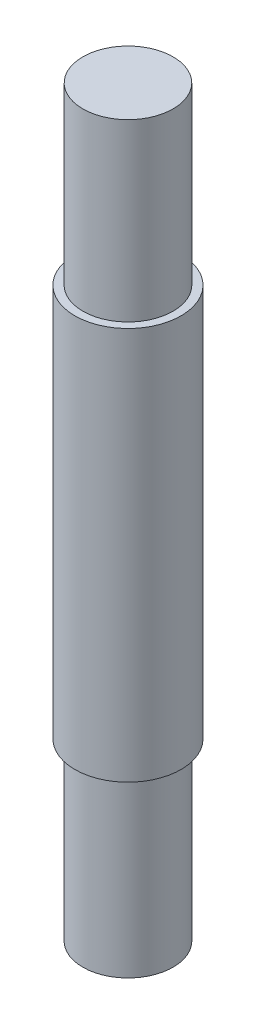
ISO-10303-21;
HEADER;
FILE_DESCRIPTION(('STEP AP214'),'2;1');
FILE_NAME('part.step','',(''),(''),'','','');
FILE_SCHEMA(('AUTOMOTIVE_DESIGN { 1 0 10303 214 1 1 1 1 }'));
ENDSEC;
DATA;
#1=APPLICATION_CONTEXT('core data for automotive mechanical design processes');
#2=APPLICATION_PROTOCOL_DEFINITION('international standard','automotive_design',2000,#1);
#3=PRODUCT_CONTEXT('',#1,'mechanical');
#4=PRODUCT('Part','Part','',(#3));
#5=PRODUCT_RELATED_PRODUCT_CATEGORY('part','',(#4));
#6=PRODUCT_DEFINITION_FORMATION('','',#4);
#7=PRODUCT_DEFINITION_CONTEXT('part definition',#1,'design');
#8=PRODUCT_DEFINITION('design','',#6,#7);
#9=PRODUCT_DEFINITION_SHAPE('','',#8);
#10=(LENGTH_UNIT() NAMED_UNIT(*) SI_UNIT(.MILLI.,.METRE.));
#11=(NAMED_UNIT(*) PLANE_ANGLE_UNIT() SI_UNIT($,.RADIAN.));
#12=(NAMED_UNIT(*) SI_UNIT($,.STERADIAN.) SOLID_ANGLE_UNIT());
#13=UNCERTAINTY_MEASURE_WITH_UNIT(LENGTH_MEASURE(1.E-05),#10,'distance_accuracy_value','');
#14=(GEOMETRIC_REPRESENTATION_CONTEXT(3) GLOBAL_UNCERTAINTY_ASSIGNED_CONTEXT((#13)) GLOBAL_UNIT_ASSIGNED_CONTEXT((#10,
#11,#12)) REPRESENTATION_CONTEXT('',''));
#15=CARTESIAN_POINT('',(0.,0.,0.));
#16=DIRECTION('',(0.,0.,1.));
#17=DIRECTION('',(1.,0.,0.));
#18=AXIS2_PLACEMENT_3D('',#15,#16,#17);
#19=CARTESIAN_POINT('',(0.,-70.,0.));
#20=DIRECTION('',(0.,1.,0.));
#21=DIRECTION('',(0.,0.,1.));
#22=AXIS2_PLACEMENT_3D('',#19,#20,#21);
#23=CYLINDRICAL_SURFACE('',#22,8.5);
#24=CARTESIAN_POINT('',(0.,-70.,0.));
#25=DIRECTION('',(0.,1.,0.));
#26=DIRECTION('',(0.,0.,1.));
#27=AXIS2_PLACEMENT_3D('',#24,#25,#26);
#28=CIRCLE('',#27,8.5);
#29=CARTESIAN_POINT('',(0.,-70.,8.5));
#30=VERTEX_POINT('',#29);
#31=EDGE_CURVE('E39',#30,#30,#28,.T.);
#32=ORIENTED_EDGE('',*,*,#31,.T.);
#33=EDGE_LOOP('',(#32));
#34=FACE_BOUND('',#33,.T.);
#35=CARTESIAN_POINT('',(0.,-37.,0.));
#36=DIRECTION('',(0.,1.,0.));
#37=DIRECTION('',(0.,0.,1.));
#38=AXIS2_PLACEMENT_3D('',#35,#36,#37);
#39=CIRCLE('',#38,8.5);
#40=CARTESIAN_POINT('',(0.,-37.,8.5));
#41=VERTEX_POINT('',#40);
#42=EDGE_CURVE('E35',#41,#41,#39,.F.);
#43=ORIENTED_EDGE('',*,*,#42,.T.);
#44=EDGE_LOOP('',(#43));
#45=FACE_BOUND('',#44,.T.);
#46=ADVANCED_FACE('F31',(#34,#45),#23,.T.);
#47=CARTESIAN_POINT('',(0.,-70.,0.));
#48=DIRECTION('',(0.,1.,0.));
#49=DIRECTION('',(0.,0.,1.));
#50=AXIS2_PLACEMENT_3D('',#47,#48,#49);
#51=PLANE('',#50);
#52=ORIENTED_EDGE('',*,*,#31,.F.);
#53=EDGE_LOOP('',(#52));
#54=FACE_BOUND('',#53,.T.);
#55=ADVANCED_FACE('F60',(#54),#51,.F.);
#56=CARTESIAN_POINT('',(0.,-37.,0.));
#57=DIRECTION('',(0.,1.,0.));
#58=DIRECTION('',(0.,0.,1.));
#59=AXIS2_PLACEMENT_3D('',#56,#57,#58);
#60=CYLINDRICAL_SURFACE('',#59,10.);
#61=CARTESIAN_POINT('',(0.,-37.,0.));
#62=DIRECTION('',(0.,1.,0.));
#63=DIRECTION('',(0.,0.,1.));
#64=AXIS2_PLACEMENT_3D('',#61,#62,#63);
#65=CIRCLE('',#64,10.);
#66=CARTESIAN_POINT('',(0.,-37.,10.));
#67=VERTEX_POINT('',#66);
#68=EDGE_CURVE('E48',#67,#67,#65,.T.);
#69=ORIENTED_EDGE('',*,*,#68,.T.);
#70=EDGE_LOOP('',(#69));
#71=FACE_BOUND('',#70,.T.);
#72=CARTESIAN_POINT('',(0.,37.,0.));
#73=DIRECTION('',(0.,1.,0.));
#74=DIRECTION('',(0.,0.,1.));
#75=AXIS2_PLACEMENT_3D('',#72,#73,#74);
#76=CIRCLE('',#75,10.);
#77=CARTESIAN_POINT('',(0.,37.,10.));
#78=VERTEX_POINT('',#77);
#79=EDGE_CURVE('E51',#78,#78,#76,.T.);
#80=ORIENTED_EDGE('',*,*,#79,.F.);
#81=EDGE_LOOP('',(#80));
#82=FACE_BOUND('',#81,.T.);
#83=ADVANCED_FACE('F57',(#71,#82),#60,.T.);
#84=CARTESIAN_POINT('',(0.,-37.,0.));
#85=DIRECTION('',(0.,1.,0.));
#86=DIRECTION('',(0.,0.,1.));
#87=AXIS2_PLACEMENT_3D('',#84,#85,#86);
#88=PLANE('',#87);
#89=ORIENTED_EDGE('',*,*,#42,.F.);
#90=EDGE_LOOP('',(#89));
#91=FACE_BOUND('',#90,.T.);
#92=ORIENTED_EDGE('',*,*,#68,.F.);
#93=EDGE_LOOP('',(#92));
#94=FACE_BOUND('',#93,.T.);
#95=ADVANCED_FACE('F59',(#91,#94),#88,.F.);
#96=CARTESIAN_POINT('',(0.,37.,0.));
#97=DIRECTION('',(0.,1.,0.));
#98=DIRECTION('',(0.,0.,1.));
#99=AXIS2_PLACEMENT_3D('',#96,#97,#98);
#100=PLANE('',#99);
#101=CARTESIAN_POINT('',(0.,37.,0.));
#102=DIRECTION('',(0.,1.,0.));
#103=DIRECTION('',(0.,0.,1.));
#104=AXIS2_PLACEMENT_3D('',#101,#102,#103);
#105=CIRCLE('',#104,8.5);
#106=CARTESIAN_POINT('',(0.,37.,8.5));
#107=VERTEX_POINT('',#106);
#108=EDGE_CURVE('E10',#107,#107,#105,.F.);
#109=ORIENTED_EDGE('',*,*,#108,.T.);
#110=EDGE_LOOP('',(#109));
#111=FACE_BOUND('',#110,.T.);
#112=ORIENTED_EDGE('',*,*,#79,.T.);
#113=EDGE_LOOP('',(#112));
#114=FACE_BOUND('',#113,.T.);
#115=ADVANCED_FACE('F55',(#111,#114),#100,.T.);
#116=CARTESIAN_POINT('',(0.,70.,0.));
#117=DIRECTION('',(0.,1.,0.));
#118=DIRECTION('',(0.,0.,1.));
#119=AXIS2_PLACEMENT_3D('',#116,#117,#118);
#120=PLANE('',#119);
#121=CARTESIAN_POINT('',(0.,70.,0.));
#122=DIRECTION('',(0.,1.,0.));
#123=DIRECTION('',(0.,0.,1.));
#124=AXIS2_PLACEMENT_3D('',#121,#122,#123);
#125=CIRCLE('',#124,8.5);
#126=CARTESIAN_POINT('',(0.,70.,8.5));
#127=VERTEX_POINT('',#126);
#128=EDGE_CURVE('E43',#127,#127,#125,.T.);
#129=ORIENTED_EDGE('',*,*,#128,.T.);
#130=EDGE_LOOP('',(#129));
#131=FACE_BOUND('',#130,.T.);
#132=ADVANCED_FACE('F77',(#131),#120,.T.);
#133=ORIENTED_EDGE('',*,*,#108,.F.);
#134=EDGE_LOOP('',(#133));
#135=FACE_BOUND('',#134,.T.);
#136=ORIENTED_EDGE('',*,*,#128,.F.);
#137=EDGE_LOOP('',(#136));
#138=FACE_BOUND('',#137,.T.);
#139=ADVANCED_FACE('F33',(#135,#138),#23,.T.);
#140=CLOSED_SHELL('',(#46,#55,#83,#95,#115,#132,#139));
#141=MANIFOLD_SOLID_BREP('B2',#140);
#142=ADVANCED_BREP_SHAPE_REPRESENTATION('',(#18,#141),#14);
#143=SHAPE_DEFINITION_REPRESENTATION(#9,#142);
ENDSEC;
END-ISO-10303-21;
